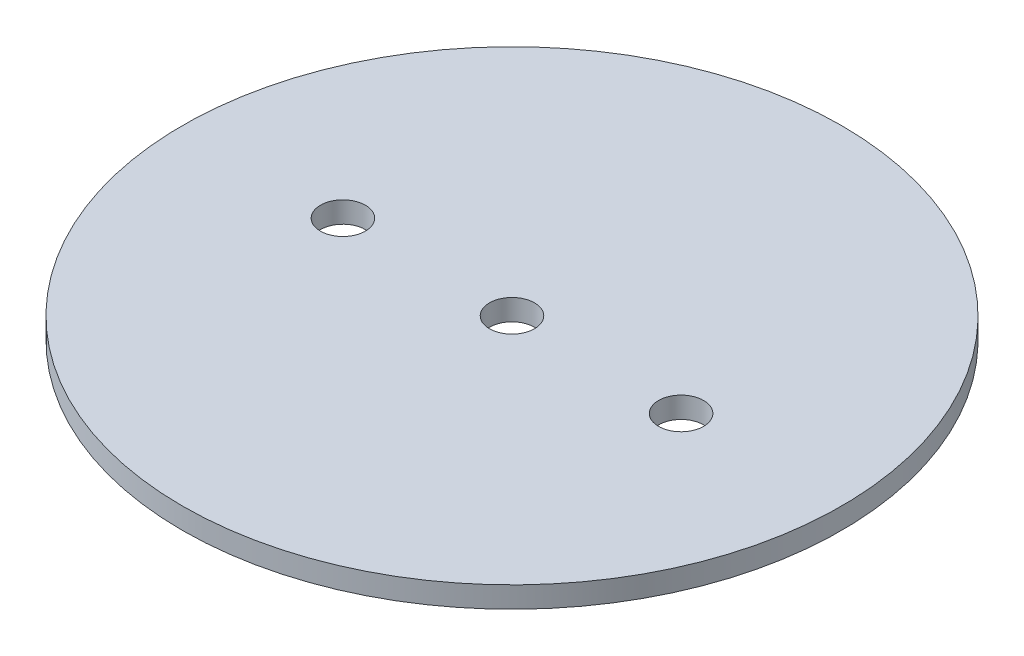
ISO-10303-21;
HEADER;
FILE_DESCRIPTION(('STEP AP214'),'2;1');
FILE_NAME('part.step','',(''),(''),'','','');
FILE_SCHEMA(('AUTOMOTIVE_DESIGN { 1 0 10303 214 1 1 1 1 }'));
ENDSEC;
DATA;
#1=APPLICATION_CONTEXT('core data for automotive mechanical design processes');
#2=APPLICATION_PROTOCOL_DEFINITION('international standard','automotive_design',2000,#1);
#3=PRODUCT_CONTEXT('',#1,'mechanical');
#4=PRODUCT('Part','Part','',(#3));
#5=PRODUCT_RELATED_PRODUCT_CATEGORY('part','',(#4));
#6=PRODUCT_DEFINITION_FORMATION('','',#4);
#7=PRODUCT_DEFINITION_CONTEXT('part definition',#1,'design');
#8=PRODUCT_DEFINITION('design','',#6,#7);
#9=PRODUCT_DEFINITION_SHAPE('','',#8);
#10=(LENGTH_UNIT() NAMED_UNIT(*) SI_UNIT(.MILLI.,.METRE.));
#11=(NAMED_UNIT(*) PLANE_ANGLE_UNIT() SI_UNIT($,.RADIAN.));
#12=(NAMED_UNIT(*) SI_UNIT($,.STERADIAN.) SOLID_ANGLE_UNIT());
#13=UNCERTAINTY_MEASURE_WITH_UNIT(LENGTH_MEASURE(1.E-05),#10,'distance_accuracy_value','');
#14=(GEOMETRIC_REPRESENTATION_CONTEXT(3) GLOBAL_UNCERTAINTY_ASSIGNED_CONTEXT((#13)) GLOBAL_UNIT_ASSIGNED_CONTEXT((#10,
#11,#12)) REPRESENTATION_CONTEXT('',''));
#15=CARTESIAN_POINT('',(0.,0.,0.));
#16=DIRECTION('',(0.,0.,1.));
#17=DIRECTION('',(1.,0.,0.));
#18=AXIS2_PLACEMENT_3D('',#15,#16,#17);
#19=CARTESIAN_POINT('',(0.,0.,0.));
#20=DIRECTION('',(0.,1.,0.));
#21=DIRECTION('',(0.,0.,1.));
#22=AXIS2_PLACEMENT_3D('',#19,#20,#21);
#23=PLANE('',#22);
#24=CARTESIAN_POINT('',(25.4,0.,0.));
#25=DIRECTION('',(0.,-1.,0.));
#26=DIRECTION('',(0.,0.,-1.));
#27=AXIS2_PLACEMENT_3D('',#24,#25,#26);
#28=CIRCLE('',#27,3.37819999999999);
#29=CARTESIAN_POINT('',(25.4,0.,-3.37819999999998));
#30=VERTEX_POINT('',#29);
#31=EDGE_CURVE('E77',#30,#30,#28,.T.);
#32=ORIENTED_EDGE('',*,*,#31,.F.);
#33=EDGE_LOOP('',(#32));
#34=FACE_BOUND('',#33,.T.);
#35=CARTESIAN_POINT('',(0.,0.,0.));
#36=DIRECTION('',(0.,-1.,0.));
#37=DIRECTION('',(0.,0.,-1.));
#38=AXIS2_PLACEMENT_3D('',#35,#36,#37);
#39=CIRCLE('',#38,3.37819999999999);
#40=CARTESIAN_POINT('',(0.,0.,-3.37819999999999));
#41=VERTEX_POINT('',#40);
#42=EDGE_CURVE('E69',#41,#41,#39,.T.);
#43=ORIENTED_EDGE('',*,*,#42,.F.);
#44=EDGE_LOOP('',(#43));
#45=FACE_BOUND('',#44,.T.);
#46=CARTESIAN_POINT('',(0.,0.,0.));
#47=DIRECTION('',(0.,1.,0.));
#48=DIRECTION('',(0.,0.,1.));
#49=AXIS2_PLACEMENT_3D('',#46,#47,#48);
#50=CIRCLE('',#49,49.5046);
#51=CARTESIAN_POINT('',(0.,0.,49.5046));
#52=VERTEX_POINT('',#51);
#53=EDGE_CURVE('E47',#52,#52,#50,.T.);
#54=ORIENTED_EDGE('',*,*,#53,.F.);
#55=EDGE_LOOP('',(#54));
#56=FACE_BOUND('',#55,.T.);
#57=CARTESIAN_POINT('',(-25.4,0.,0.));
#58=DIRECTION('',(0.,-1.,0.));
#59=DIRECTION('',(0.,0.,-1.));
#60=AXIS2_PLACEMENT_3D('',#57,#58,#59);
#61=CIRCLE('',#60,3.37819999999999);
#62=CARTESIAN_POINT('',(-25.4,0.,-3.37819999999999));
#63=VERTEX_POINT('',#62);
#64=EDGE_CURVE('E61',#63,#63,#61,.T.);
#65=ORIENTED_EDGE('',*,*,#64,.F.);
#66=EDGE_LOOP('',(#65));
#67=FACE_BOUND('',#66,.T.);
#68=ADVANCED_FACE('F43',(#34,#45,#56,#67),#23,.F.);
#69=CARTESIAN_POINT('',(0.,3.175,0.));
#70=DIRECTION('',(0.,1.,0.));
#71=DIRECTION('',(0.,0.,1.));
#72=AXIS2_PLACEMENT_3D('',#69,#70,#71);
#73=PLANE('',#72);
#74=CARTESIAN_POINT('',(25.4,3.175,0.));
#75=DIRECTION('',(0.,-1.,0.));
#76=DIRECTION('',(0.,0.,-1.));
#77=AXIS2_PLACEMENT_3D('',#74,#75,#76);
#78=CIRCLE('',#77,3.37819999999999);
#79=CARTESIAN_POINT('',(25.4,3.175,-3.37819999999998));
#80=VERTEX_POINT('',#79);
#81=EDGE_CURVE('E73',#80,#80,#78,.T.);
#82=ORIENTED_EDGE('',*,*,#81,.T.);
#83=EDGE_LOOP('',(#82));
#84=FACE_BOUND('',#83,.T.);
#85=CARTESIAN_POINT('',(0.,3.175,0.));
#86=DIRECTION('',(0.,-1.,0.));
#87=DIRECTION('',(0.,0.,-1.));
#88=AXIS2_PLACEMENT_3D('',#85,#86,#87);
#89=CIRCLE('',#88,3.37819999999999);
#90=CARTESIAN_POINT('',(0.,3.175,-3.37819999999999));
#91=VERTEX_POINT('',#90);
#92=EDGE_CURVE('E65',#91,#91,#89,.T.);
#93=ORIENTED_EDGE('',*,*,#92,.T.);
#94=EDGE_LOOP('',(#93));
#95=FACE_BOUND('',#94,.T.);
#96=CARTESIAN_POINT('',(0.,3.175,0.));
#97=DIRECTION('',(0.,1.,0.));
#98=DIRECTION('',(0.,0.,1.));
#99=AXIS2_PLACEMENT_3D('',#96,#97,#98);
#100=CIRCLE('',#99,49.5046);
#101=CARTESIAN_POINT('',(0.,3.175,49.5046));
#102=VERTEX_POINT('',#101);
#103=EDGE_CURVE('E10',#102,#102,#100,.T.);
#104=ORIENTED_EDGE('',*,*,#103,.T.);
#105=EDGE_LOOP('',(#104));
#106=FACE_BOUND('',#105,.T.);
#107=CARTESIAN_POINT('',(-25.4,3.175,0.));
#108=DIRECTION('',(0.,-1.,0.));
#109=DIRECTION('',(0.,0.,-1.));
#110=AXIS2_PLACEMENT_3D('',#107,#108,#109);
#111=CIRCLE('',#110,3.37819999999999);
#112=CARTESIAN_POINT('',(-25.4,3.175,-3.37819999999999));
#113=VERTEX_POINT('',#112);
#114=EDGE_CURVE('E56',#113,#113,#111,.T.);
#115=ORIENTED_EDGE('',*,*,#114,.T.);
#116=EDGE_LOOP('',(#115));
#117=FACE_BOUND('',#116,.T.);
#118=ADVANCED_FACE('F86',(#84,#95,#106,#117),#73,.T.);
#119=CARTESIAN_POINT('',(0.,3.175,0.));
#120=DIRECTION('',(0.,-1.,0.));
#121=DIRECTION('',(0.,0.,-1.));
#122=AXIS2_PLACEMENT_3D('',#119,#120,#121);
#123=CYLINDRICAL_SURFACE('',#122,49.5046);
#124=ORIENTED_EDGE('',*,*,#103,.F.);
#125=EDGE_LOOP('',(#124));
#126=FACE_BOUND('',#125,.T.);
#127=ORIENTED_EDGE('',*,*,#53,.T.);
#128=EDGE_LOOP('',(#127));
#129=FACE_BOUND('',#128,.T.);
#130=ADVANCED_FACE('F45',(#126,#129),#123,.T.);
#131=CARTESIAN_POINT('',(-25.4,0.,0.));
#132=DIRECTION('',(0.,-1.,0.));
#133=DIRECTION('',(0.,0.,-1.));
#134=AXIS2_PLACEMENT_3D('',#131,#132,#133);
#135=CYLINDRICAL_SURFACE('',#134,3.37819999999999);
#136=ORIENTED_EDGE('',*,*,#114,.F.);
#137=EDGE_LOOP('',(#136));
#138=FACE_BOUND('',#137,.T.);
#139=ORIENTED_EDGE('',*,*,#64,.T.);
#140=EDGE_LOOP('',(#139));
#141=FACE_BOUND('',#140,.T.);
#142=ADVANCED_FACE('F93',(#138,#141),#135,.F.);
#143=CARTESIAN_POINT('',(0.,0.,0.));
#144=DIRECTION('',(0.,-1.,0.));
#145=DIRECTION('',(0.,0.,-1.));
#146=AXIS2_PLACEMENT_3D('',#143,#144,#145);
#147=CYLINDRICAL_SURFACE('',#146,3.37819999999999);
#148=ORIENTED_EDGE('',*,*,#92,.F.);
#149=EDGE_LOOP('',(#148));
#150=FACE_BOUND('',#149,.T.);
#151=ORIENTED_EDGE('',*,*,#42,.T.);
#152=EDGE_LOOP('',(#151));
#153=FACE_BOUND('',#152,.T.);
#154=ADVANCED_FACE('F95',(#150,#153),#147,.F.);
#155=CARTESIAN_POINT('',(25.4,0.,0.));
#156=DIRECTION('',(0.,-1.,0.));
#157=DIRECTION('',(0.,0.,-1.));
#158=AXIS2_PLACEMENT_3D('',#155,#156,#157);
#159=CYLINDRICAL_SURFACE('',#158,3.37819999999999);
#160=ORIENTED_EDGE('',*,*,#81,.F.);
#161=EDGE_LOOP('',(#160));
#162=FACE_BOUND('',#161,.T.);
#163=ORIENTED_EDGE('',*,*,#31,.T.);
#164=EDGE_LOOP('',(#163));
#165=FACE_BOUND('',#164,.T.);
#166=ADVANCED_FACE('F82',(#162,#165),#159,.F.);
#167=CLOSED_SHELL('',(#68,#118,#130,#142,#154,#166));
#168=MANIFOLD_SOLID_BREP('B2',#167);
#169=ADVANCED_BREP_SHAPE_REPRESENTATION('',(#18,#168),#14);
#170=SHAPE_DEFINITION_REPRESENTATION(#9,#169);
ENDSEC;
END-ISO-10303-21;
